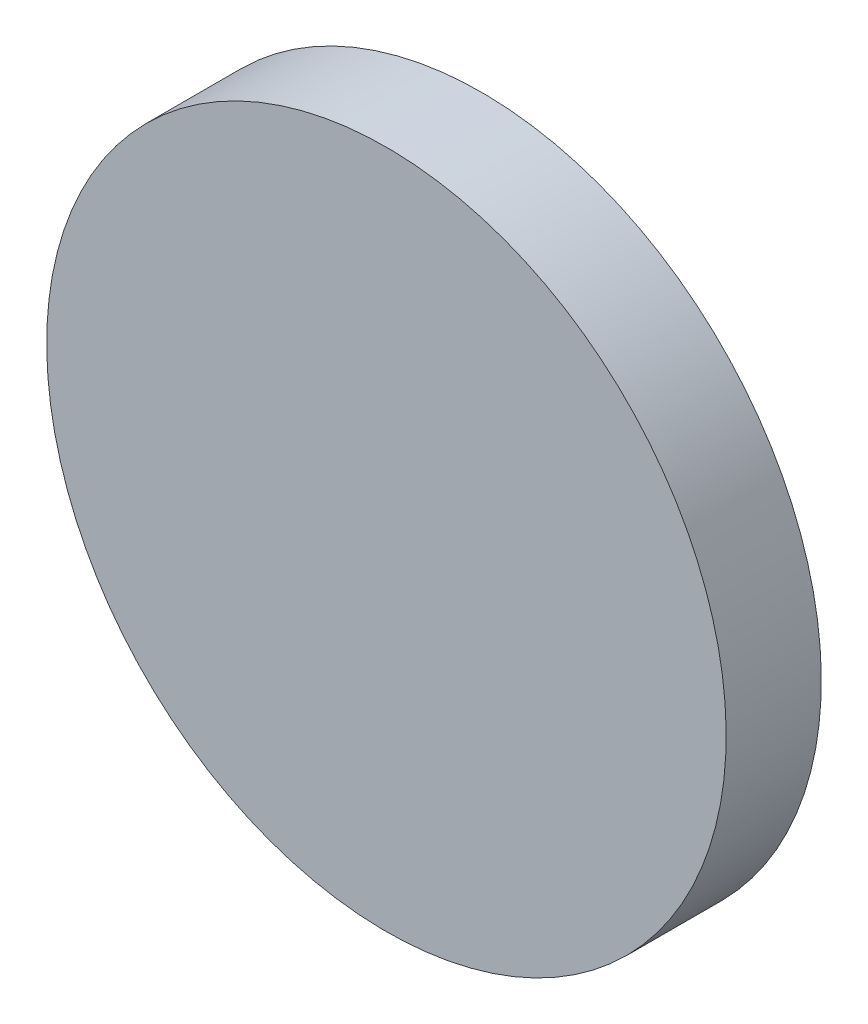
ISO-10303-21;
HEADER;
FILE_DESCRIPTION(('STEP AP214'),'2;1');
FILE_NAME('part.step','',(''),(''),'','','');
FILE_SCHEMA(('AUTOMOTIVE_DESIGN { 1 0 10303 214 1 1 1 1 }'));
ENDSEC;
DATA;
#1=APPLICATION_CONTEXT('core data for automotive mechanical design processes');
#2=APPLICATION_PROTOCOL_DEFINITION('international standard','automotive_design',2000,#1);
#3=PRODUCT_CONTEXT('',#1,'mechanical');
#4=PRODUCT('Part','Part','',(#3));
#5=PRODUCT_RELATED_PRODUCT_CATEGORY('part','',(#4));
#6=PRODUCT_DEFINITION_FORMATION('','',#4);
#7=PRODUCT_DEFINITION_CONTEXT('part definition',#1,'design');
#8=PRODUCT_DEFINITION('design','',#6,#7);
#9=PRODUCT_DEFINITION_SHAPE('','',#8);
#10=(LENGTH_UNIT() NAMED_UNIT(*) SI_UNIT(.MILLI.,.METRE.));
#11=(NAMED_UNIT(*) PLANE_ANGLE_UNIT() SI_UNIT($,.RADIAN.));
#12=(NAMED_UNIT(*) SI_UNIT($,.STERADIAN.) SOLID_ANGLE_UNIT());
#13=UNCERTAINTY_MEASURE_WITH_UNIT(LENGTH_MEASURE(1.E-05),#10,'distance_accuracy_value','');
#14=(GEOMETRIC_REPRESENTATION_CONTEXT(3) GLOBAL_UNCERTAINTY_ASSIGNED_CONTEXT((#13)) GLOBAL_UNIT_ASSIGNED_CONTEXT((#10,
#11,#12)) REPRESENTATION_CONTEXT('',''));
#15=CARTESIAN_POINT('',(0.,0.,0.));
#16=DIRECTION('',(0.,0.,1.));
#17=DIRECTION('',(1.,0.,0.));
#18=AXIS2_PLACEMENT_3D('',#15,#16,#17);
#19=CARTESIAN_POINT('',(96.20677736,87.59706382,0.));
#20=DIRECTION('',(-0.707106781186548,0.707106781186548,0.));
#21=DIRECTION('',(0.707106781186548,0.707106781186548,0.));
#22=AXIS2_PLACEMENT_3D('',#19,#20,#21);
#23=PLANE('',#22);
#24=DIRECTION('',(0.707106781186548,0.707106781186548,0.));
#25=VECTOR('',#24,1.);
#26=CARTESIAN_POINT('',(96.20677736,87.59706382,0.03556));
#27=LINE('',#26,#25);
#28=CARTESIAN_POINT('',(96.20677736,87.59706382,0.03556));
#29=VERTEX_POINT('',#28);
#30=CARTESIAN_POINT('',(96.2068053,87.59709176,0.03556));
#31=VERTEX_POINT('',#30);
#32=EDGE_CURVE('E11',#29,#31,#27,.T.);
#33=ORIENTED_EDGE('',*,*,#32,.F.);
#34=DIRECTION('',(0.,0.,1.));
#35=VECTOR('',#34,1.);
#36=CARTESIAN_POINT('',(96.20677736,87.59706382,0.));
#37=LINE('',#36,#35);
#38=CARTESIAN_POINT('',(96.20677736,87.59706382,0.));
#39=VERTEX_POINT('',#38);
#40=EDGE_CURVE('E24',#39,#29,#37,.T.);
#41=ORIENTED_EDGE('',*,*,#40,.F.);
#42=DIRECTION('',(0.707106781186548,0.707106781186548,0.));
#43=VECTOR('',#42,1.);
#44=CARTESIAN_POINT('',(96.20677736,87.59706382,0.));
#45=LINE('',#44,#43);
#46=CARTESIAN_POINT('',(96.2068053,87.59709176,0.));
#47=VERTEX_POINT('',#46);
#48=EDGE_CURVE('E75',#39,#47,#45,.T.);
#49=ORIENTED_EDGE('',*,*,#48,.T.);
#50=DIRECTION('',(0.,0.,1.));
#51=VECTOR('',#50,1.);
#52=CARTESIAN_POINT('',(96.2068053,87.59709176,0.));
#53=LINE('',#52,#51);
#54=EDGE_CURVE('E37',#47,#31,#53,.T.);
#55=ORIENTED_EDGE('',*,*,#54,.T.);
#56=EDGE_LOOP('',(#33,#41,#49,#55));
#57=FACE_BOUND('',#56,.T.);
#58=ADVANCED_FACE('F17',(#57),#23,.F.);
#59=CARTESIAN_POINT('',(96.11700233,87.68689473,0.));
#60=DIRECTION('',(0.,0.,-1.));
#61=DIRECTION('',(0.707106781186548,-0.707106781186548,0.));
#62=AXIS2_PLACEMENT_3D('',#59,#60,#61);
#63=CYLINDRICAL_SURFACE('',#62,0.127000578115386);
#64=CARTESIAN_POINT('',(96.11700233,87.68689473,0.03556));
#65=DIRECTION('',(0.,0.,1.));
#66=DIRECTION('',(0.707106781186548,-0.707106781186548,0.));
#67=AXIS2_PLACEMENT_3D('',#64,#65,#66);
#68=CIRCLE('',#67,0.127000578115386);
#69=CARTESIAN_POINT('',(96.02719936,87.7766977,0.03556));
#70=VERTEX_POINT('',#69);
#71=EDGE_CURVE('E83',#31,#70,#68,.T.);
#72=ORIENTED_EDGE('',*,*,#71,.F.);
#73=ORIENTED_EDGE('',*,*,#54,.F.);
#74=CARTESIAN_POINT('',(96.11700233,87.68689473,0.));
#75=DIRECTION('',(0.,0.,1.));
#76=DIRECTION('',(0.707106781186548,-0.707106781186548,0.));
#77=AXIS2_PLACEMENT_3D('',#74,#75,#76);
#78=CIRCLE('',#77,0.127000578115386);
#79=CARTESIAN_POINT('',(96.02719936,87.7766977,0.));
#80=VERTEX_POINT('',#79);
#81=EDGE_CURVE('E81',#47,#80,#78,.T.);
#82=ORIENTED_EDGE('',*,*,#81,.T.);
#83=DIRECTION('',(0.,0.,1.));
#84=VECTOR('',#83,1.);
#85=CARTESIAN_POINT('',(96.02719936,87.7766977,0.));
#86=LINE('',#85,#84);
#87=EDGE_CURVE('E67',#80,#70,#86,.T.);
#88=ORIENTED_EDGE('',*,*,#87,.T.);
#89=EDGE_LOOP('',(#72,#73,#82,#88));
#90=FACE_BOUND('',#89,.T.);
#91=ADVANCED_FACE('F89',(#90),#63,.T.);
#92=CARTESIAN_POINT('',(96.02719936,87.7766977,0.));
#93=DIRECTION('',(0.707106781186548,-0.707106781186548,0.));
#94=DIRECTION('',(-0.707106781186548,-0.707106781186548,0.));
#95=AXIS2_PLACEMENT_3D('',#92,#93,#94);
#96=PLANE('',#95);
#97=DIRECTION('',(-0.707106781186548,-0.707106781186548,0.));
#98=VECTOR('',#97,1.);
#99=CARTESIAN_POINT('',(96.02719936,87.7766977,0.03556));
#100=LINE('',#99,#98);
#101=CARTESIAN_POINT('',(96.02717142,87.77666976,0.03556));
#102=VERTEX_POINT('',#101);
#103=EDGE_CURVE('E71',#70,#102,#100,.T.);
#104=ORIENTED_EDGE('',*,*,#103,.F.);
#105=ORIENTED_EDGE('',*,*,#87,.F.);
#106=DIRECTION('',(-0.707106781186548,-0.707106781186548,0.));
#107=VECTOR('',#106,1.);
#108=CARTESIAN_POINT('',(96.02719936,87.7766977,0.));
#109=LINE('',#108,#107);
#110=CARTESIAN_POINT('',(96.02717142,87.77666976,0.));
#111=VERTEX_POINT('',#110);
#112=EDGE_CURVE('E63',#80,#111,#109,.T.);
#113=ORIENTED_EDGE('',*,*,#112,.T.);
#114=DIRECTION('',(0.,0.,1.));
#115=VECTOR('',#114,1.);
#116=CARTESIAN_POINT('',(96.02717142,87.77666976,0.));
#117=LINE('',#116,#115);
#118=EDGE_CURVE('E53',#111,#102,#117,.T.);
#119=ORIENTED_EDGE('',*,*,#118,.T.);
#120=EDGE_LOOP('',(#104,#105,#113,#119));
#121=FACE_BOUND('',#120,.T.);
#122=ADVANCED_FACE('F66',(#121),#96,.F.);
#123=CARTESIAN_POINT('',(96.11697439,87.68686679,0.));
#124=DIRECTION('',(0.,0.,-1.));
#125=DIRECTION('',(-0.707106781186548,0.707106781186548,0.));
#126=AXIS2_PLACEMENT_3D('',#123,#124,#125);
#127=CYLINDRICAL_SURFACE('',#126,0.127000578115386);
#128=CARTESIAN_POINT('',(96.11697439,87.68686679,0.03556));
#129=DIRECTION('',(0.,0.,1.));
#130=DIRECTION('',(-0.707106781186548,0.707106781186548,0.));
#131=AXIS2_PLACEMENT_3D('',#128,#129,#130);
#132=CIRCLE('',#131,0.127000578115386);
#133=EDGE_CURVE('E59',#102,#29,#132,.T.);
#134=ORIENTED_EDGE('',*,*,#133,.F.);
#135=ORIENTED_EDGE('',*,*,#118,.F.);
#136=CARTESIAN_POINT('',(96.11697439,87.68686679,0.));
#137=DIRECTION('',(0.,0.,1.));
#138=DIRECTION('',(-0.707106781186548,0.707106781186548,0.));
#139=AXIS2_PLACEMENT_3D('',#136,#137,#138);
#140=CIRCLE('',#139,0.127000578115386);
#141=EDGE_CURVE('E57',#111,#39,#140,.T.);
#142=ORIENTED_EDGE('',*,*,#141,.T.);
#143=ORIENTED_EDGE('',*,*,#40,.T.);
#144=EDGE_LOOP('',(#134,#135,#142,#143));
#145=FACE_BOUND('',#144,.T.);
#146=ADVANCED_FACE('F55',(#145),#127,.T.);
#147=CARTESIAN_POINT('',(96.20677736,87.59706382,0.));
#148=DIRECTION('',(0.,0.,-1.));
#149=DIRECTION('',(-1.,0.,0.));
#150=AXIS2_PLACEMENT_3D('',#147,#148,#149);
#151=PLANE('',#150);
#152=ORIENTED_EDGE('',*,*,#141,.F.);
#153=ORIENTED_EDGE('',*,*,#112,.F.);
#154=ORIENTED_EDGE('',*,*,#81,.F.);
#155=ORIENTED_EDGE('',*,*,#48,.F.);
#156=EDGE_LOOP('',(#152,#153,#154,#155));
#157=FACE_BOUND('',#156,.T.);
#158=ADVANCED_FACE('F74',(#157),#151,.T.);
#159=CARTESIAN_POINT('',(96.20677736,87.59706382,0.03556));
#160=DIRECTION('',(0.,0.,-1.));
#161=DIRECTION('',(-1.,0.,0.));
#162=AXIS2_PLACEMENT_3D('',#159,#160,#161);
#163=PLANE('',#162);
#164=ORIENTED_EDGE('',*,*,#32,.T.);
#165=ORIENTED_EDGE('',*,*,#71,.T.);
#166=ORIENTED_EDGE('',*,*,#103,.T.);
#167=ORIENTED_EDGE('',*,*,#133,.T.);
#168=EDGE_LOOP('',(#164,#165,#166,#167));
#169=FACE_BOUND('',#168,.T.);
#170=ADVANCED_FACE('F91',(#169),#163,.F.);
#171=CLOSED_SHELL('',(#58,#91,#122,#146,#158,#170));
#172=MANIFOLD_SOLID_BREP('B1',#171);
#173=ADVANCED_BREP_SHAPE_REPRESENTATION('',(#18,#172),#14);
#174=SHAPE_DEFINITION_REPRESENTATION(#9,#173);
ENDSEC;
END-ISO-10303-21;
